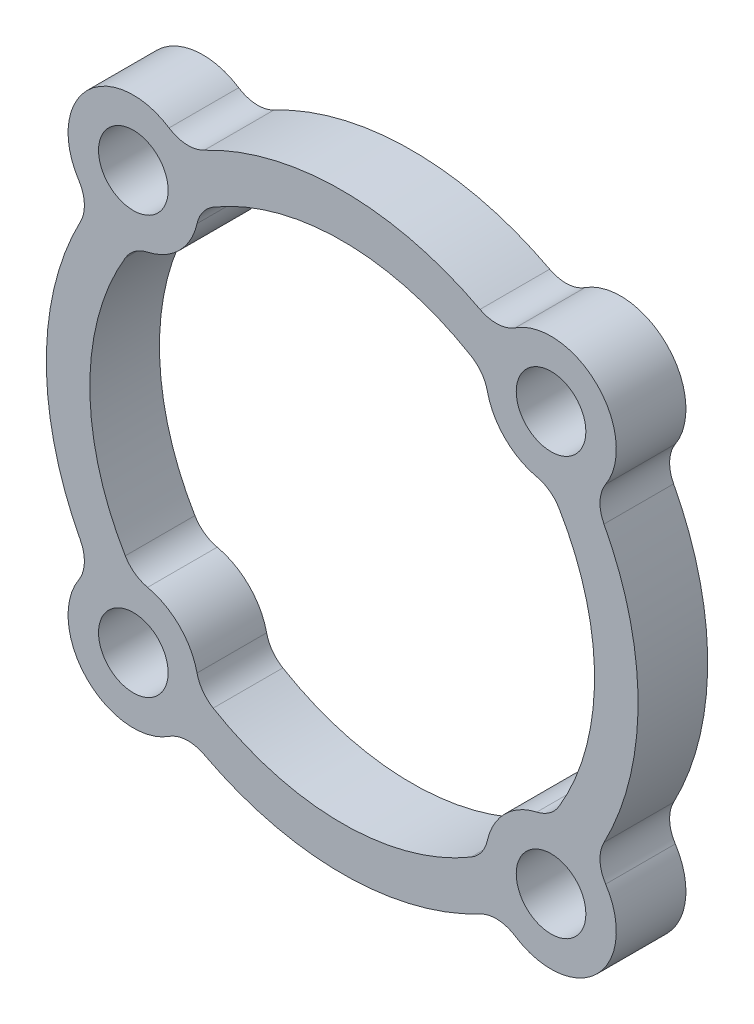
ISO-10303-21;
HEADER;
FILE_DESCRIPTION(('STEP AP214'),'2;1');
FILE_NAME('part.step','',(''),(''),'','','');
FILE_SCHEMA(('AUTOMOTIVE_DESIGN { 1 0 10303 214 1 1 1 1 }'));
ENDSEC;
DATA;
#1=APPLICATION_CONTEXT('core data for automotive mechanical design processes');
#2=APPLICATION_PROTOCOL_DEFINITION('international standard','automotive_design',2000,#1);
#3=PRODUCT_CONTEXT('',#1,'mechanical');
#4=PRODUCT('Part','Part','',(#3));
#5=PRODUCT_RELATED_PRODUCT_CATEGORY('part','',(#4));
#6=PRODUCT_DEFINITION_FORMATION('','',#4);
#7=PRODUCT_DEFINITION_CONTEXT('part definition',#1,'design');
#8=PRODUCT_DEFINITION('design','',#6,#7);
#9=PRODUCT_DEFINITION_SHAPE('','',#8);
#10=(LENGTH_UNIT() NAMED_UNIT(*) SI_UNIT(.MILLI.,.METRE.));
#11=(NAMED_UNIT(*) PLANE_ANGLE_UNIT() SI_UNIT($,.RADIAN.));
#12=(NAMED_UNIT(*) SI_UNIT($,.STERADIAN.) SOLID_ANGLE_UNIT());
#13=UNCERTAINTY_MEASURE_WITH_UNIT(LENGTH_MEASURE(1.E-05),#10,'distance_accuracy_value','');
#14=(GEOMETRIC_REPRESENTATION_CONTEXT(3) GLOBAL_UNCERTAINTY_ASSIGNED_CONTEXT((#13)) GLOBAL_UNIT_ASSIGNED_CONTEXT((#10,
#11,#12)) REPRESENTATION_CONTEXT('',''));
#15=CARTESIAN_POINT('',(0.,0.,0.));
#16=DIRECTION('',(0.,0.,1.));
#17=DIRECTION('',(1.,0.,0.));
#18=AXIS2_PLACEMENT_3D('',#15,#16,#17);
#19=CARTESIAN_POINT('',(0.,0.,4.));
#20=DIRECTION('',(0.,0.,-1.));
#21=DIRECTION('',(-1.,0.,0.));
#22=AXIS2_PLACEMENT_3D('',#19,#20,#21);
#23=CYLINDRICAL_SURFACE('',#22,17.);
#24=CARTESIAN_POINT('',(0.,0.,0.));
#25=DIRECTION('',(0.,0.,1.));
#26=DIRECTION('',(1.,0.,0.));
#27=AXIS2_PLACEMENT_3D('',#24,#25,#26);
#28=CIRCLE('',#27,17.);
#29=CARTESIAN_POINT('',(-7.92039877884297,-15.0421834579991,0.));
#30=VERTEX_POINT('',#29);
#31=CARTESIAN_POINT('',(7.92039877884298,-15.0421834579991,0.));
#32=VERTEX_POINT('',#31);
#33=EDGE_CURVE('E508',#30,#32,#28,.T.);
#34=ORIENTED_EDGE('',*,*,#33,.T.);
#35=DIRECTION('',(0.,0.,-1.));
#36=VECTOR('',#35,1.);
#37=CARTESIAN_POINT('',(7.92039877884298,-15.0421834579991,4.));
#38=LINE('',#37,#36);
#39=CARTESIAN_POINT('',(7.92039877884298,-15.0421834579991,4.));
#40=VERTEX_POINT('',#39);
#41=EDGE_CURVE('E289',#32,#40,#38,.F.);
#42=ORIENTED_EDGE('',*,*,#41,.T.);
#43=CARTESIAN_POINT('',(0.,0.,4.));
#44=DIRECTION('',(0.,0.,1.));
#45=DIRECTION('',(1.,0.,0.));
#46=AXIS2_PLACEMENT_3D('',#43,#44,#45);
#47=CIRCLE('',#46,17.);
#48=CARTESIAN_POINT('',(-7.92039877884297,-15.0421834579991,4.));
#49=VERTEX_POINT('',#48);
#50=EDGE_CURVE('E479',#49,#40,#47,.T.);
#51=ORIENTED_EDGE('',*,*,#50,.F.);
#52=DIRECTION('',(0.,0.,-1.));
#53=VECTOR('',#52,1.);
#54=CARTESIAN_POINT('',(-7.92039877884297,-15.0421834579991,4.));
#55=LINE('',#54,#53);
#56=EDGE_CURVE('E287',#49,#30,#55,.T.);
#57=ORIENTED_EDGE('',*,*,#56,.T.);
#58=EDGE_LOOP('',(#34,#42,#51,#57));
#59=FACE_BOUND('',#58,.T.);
#60=ADVANCED_FACE('F33',(#59),#23,.T.);
#61=CARTESIAN_POINT('',(15.0421834579991,-7.92039877884297,0.));
#62=VERTEX_POINT('',#61);
#63=CARTESIAN_POINT('',(15.0421834579991,7.92039877884297,0.));
#64=VERTEX_POINT('',#63);
#65=EDGE_CURVE('E466',#62,#64,#28,.T.);
#66=ORIENTED_EDGE('',*,*,#65,.T.);
#67=DIRECTION('',(0.,0.,-1.));
#68=VECTOR('',#67,1.);
#69=CARTESIAN_POINT('',(15.0421834579991,7.92039877884297,4.));
#70=LINE('',#69,#68);
#71=CARTESIAN_POINT('',(15.0421834579991,7.92039877884297,4.));
#72=VERTEX_POINT('',#71);
#73=EDGE_CURVE('E274',#64,#72,#70,.F.);
#74=ORIENTED_EDGE('',*,*,#73,.T.);
#75=CARTESIAN_POINT('',(15.0421834579991,-7.92039877884297,4.));
#76=VERTEX_POINT('',#75);
#77=EDGE_CURVE('E252',#76,#72,#47,.T.);
#78=ORIENTED_EDGE('',*,*,#77,.F.);
#79=DIRECTION('',(0.,0.,-1.));
#80=VECTOR('',#79,1.);
#81=CARTESIAN_POINT('',(15.0421834579991,-7.92039877884297,4.));
#82=LINE('',#81,#80);
#83=EDGE_CURVE('E272',#76,#62,#82,.T.);
#84=ORIENTED_EDGE('',*,*,#83,.T.);
#85=EDGE_LOOP('',(#66,#74,#78,#84));
#86=FACE_BOUND('',#85,.T.);
#87=ADVANCED_FACE('F507',(#86),#23,.T.);
#88=CARTESIAN_POINT('',(0.,0.,4.));
#89=DIRECTION('',(0.,0.,-1.));
#90=DIRECTION('',(-1.,0.,0.));
#91=AXIS2_PLACEMENT_3D('',#88,#89,#90);
#92=CYLINDRICAL_SURFACE('',#91,14.5);
#93=CARTESIAN_POINT('',(0.,0.,4.));
#94=DIRECTION('',(0.,0.,1.));
#95=DIRECTION('',(1.,0.,0.));
#96=AXIS2_PLACEMENT_3D('',#93,#94,#95);
#97=CIRCLE('',#96,14.5);
#98=CARTESIAN_POINT('',(-7.41108391552855,-12.4629785844715,4.));
#99=VERTEX_POINT('',#98);
#100=CARTESIAN_POINT('',(7.41108391552855,-12.4629785844715,4.));
#101=VERTEX_POINT('',#100);
#102=EDGE_CURVE('E452',#99,#101,#97,.T.);
#103=ORIENTED_EDGE('',*,*,#102,.T.);
#104=DIRECTION('',(0.,0.,-1.));
#105=VECTOR('',#104,1.);
#106=CARTESIAN_POINT('',(7.41108391552855,-12.4629785844715,4.));
#107=LINE('',#106,#105);
#108=CARTESIAN_POINT('',(7.41108391552855,-12.4629785844715,0.));
#109=VERTEX_POINT('',#108);
#110=EDGE_CURVE('E342',#101,#109,#107,.T.);
#111=ORIENTED_EDGE('',*,*,#110,.T.);
#112=CARTESIAN_POINT('',(0.,0.,0.));
#113=DIRECTION('',(0.,0.,1.));
#114=DIRECTION('',(1.,0.,0.));
#115=AXIS2_PLACEMENT_3D('',#112,#113,#114);
#116=CIRCLE('',#115,14.5);
#117=CARTESIAN_POINT('',(-7.41108391552855,-12.4629785844715,0.));
#118=VERTEX_POINT('',#117);
#119=EDGE_CURVE('E457',#118,#109,#116,.T.);
#120=ORIENTED_EDGE('',*,*,#119,.F.);
#121=DIRECTION('',(0.,0.,-1.));
#122=VECTOR('',#121,1.);
#123=CARTESIAN_POINT('',(-7.41108391552855,-12.4629785844715,4.));
#124=LINE('',#123,#122);
#125=EDGE_CURVE('E339',#118,#99,#124,.F.);
#126=ORIENTED_EDGE('',*,*,#125,.T.);
#127=EDGE_LOOP('',(#103,#111,#120,#126));
#128=FACE_BOUND('',#127,.T.);
#129=ADVANCED_FACE('F543',(#128),#92,.F.);
#130=CARTESIAN_POINT('',(12.4629785844715,-7.41108391552854,0.));
#131=VERTEX_POINT('',#130);
#132=CARTESIAN_POINT('',(12.4629785844715,7.41108391552855,0.));
#133=VERTEX_POINT('',#132);
#134=EDGE_CURVE('E549',#131,#133,#116,.T.);
#135=ORIENTED_EDGE('',*,*,#134,.F.);
#136=DIRECTION('',(0.,0.,-1.));
#137=VECTOR('',#136,1.);
#138=CARTESIAN_POINT('',(12.4629785844715,-7.41108391552854,4.));
#139=LINE('',#138,#137);
#140=CARTESIAN_POINT('',(12.4629785844715,-7.41108391552854,4.));
#141=VERTEX_POINT('',#140);
#142=EDGE_CURVE('E352',#131,#141,#139,.F.);
#143=ORIENTED_EDGE('',*,*,#142,.T.);
#144=CARTESIAN_POINT('',(12.4629785844715,7.41108391552855,4.));
#145=VERTEX_POINT('',#144);
#146=EDGE_CURVE('E567',#141,#145,#97,.T.);
#147=ORIENTED_EDGE('',*,*,#146,.T.);
#148=DIRECTION('',(0.,0.,-1.));
#149=VECTOR('',#148,1.);
#150=CARTESIAN_POINT('',(12.4629785844715,7.41108391552855,4.));
#151=LINE('',#150,#149);
#152=EDGE_CURVE('E349',#145,#133,#151,.T.);
#153=ORIENTED_EDGE('',*,*,#152,.T.);
#154=EDGE_LOOP('',(#135,#143,#147,#153));
#155=FACE_BOUND('',#154,.T.);
#156=ADVANCED_FACE('F565',(#155),#92,.F.);
#157=CARTESIAN_POINT('',(-15.0421834579991,7.92039877884298,0.));
#158=VERTEX_POINT('',#157);
#159=CARTESIAN_POINT('',(-15.0421834579991,-7.92039877884298,0.));
#160=VERTEX_POINT('',#159);
#161=EDGE_CURVE('E462',#158,#160,#28,.T.);
#162=ORIENTED_EDGE('',*,*,#161,.T.);
#163=DIRECTION('',(0.,0.,-1.));
#164=VECTOR('',#163,1.);
#165=CARTESIAN_POINT('',(-15.0421834579991,-7.92039877884298,4.));
#166=LINE('',#165,#164);
#167=CARTESIAN_POINT('',(-15.0421834579991,-7.92039877884298,4.));
#168=VERTEX_POINT('',#167);
#169=EDGE_CURVE('E300',#160,#168,#166,.F.);
#170=ORIENTED_EDGE('',*,*,#169,.T.);
#171=CARTESIAN_POINT('',(-15.0421834579991,7.92039877884298,4.));
#172=VERTEX_POINT('',#171);
#173=EDGE_CURVE('E463',#172,#168,#47,.T.);
#174=ORIENTED_EDGE('',*,*,#173,.F.);
#175=DIRECTION('',(0.,0.,-1.));
#176=VECTOR('',#175,1.);
#177=CARTESIAN_POINT('',(-15.0421834579991,7.92039877884298,4.));
#178=LINE('',#177,#176);
#179=EDGE_CURVE('E297',#172,#158,#178,.T.);
#180=ORIENTED_EDGE('',*,*,#179,.T.);
#181=EDGE_LOOP('',(#162,#170,#174,#180));
#182=FACE_BOUND('',#181,.T.);
#183=ADVANCED_FACE('F513',(#182),#23,.T.);
#184=CARTESIAN_POINT('',(-12.4629785844715,7.41108391552855,4.));
#185=VERTEX_POINT('',#184);
#186=CARTESIAN_POINT('',(-12.4629785844715,-7.41108391552855,4.));
#187=VERTEX_POINT('',#186);
#188=EDGE_CURVE('E448',#185,#187,#97,.T.);
#189=ORIENTED_EDGE('',*,*,#188,.T.);
#190=DIRECTION('',(0.,0.,-1.));
#191=VECTOR('',#190,1.);
#192=CARTESIAN_POINT('',(-12.4629785844715,-7.41108391552855,4.));
#193=LINE('',#192,#191);
#194=CARTESIAN_POINT('',(-12.4629785844715,-7.41108391552855,0.));
#195=VERTEX_POINT('',#194);
#196=EDGE_CURVE('E370',#187,#195,#193,.T.);
#197=ORIENTED_EDGE('',*,*,#196,.T.);
#198=CARTESIAN_POINT('',(-12.4629785844715,7.41108391552855,0.));
#199=VERTEX_POINT('',#198);
#200=EDGE_CURVE('E454',#199,#195,#116,.T.);
#201=ORIENTED_EDGE('',*,*,#200,.F.);
#202=DIRECTION('',(0.,0.,-1.));
#203=VECTOR('',#202,1.);
#204=CARTESIAN_POINT('',(-12.4629785844715,7.41108391552855,4.));
#205=LINE('',#204,#203);
#206=EDGE_CURVE('E368',#199,#185,#205,.F.);
#207=ORIENTED_EDGE('',*,*,#206,.T.);
#208=EDGE_LOOP('',(#189,#197,#201,#207));
#209=FACE_BOUND('',#208,.T.);
#210=ADVANCED_FACE('F581',(#209),#92,.F.);
#211=CARTESIAN_POINT('',(7.92039877884297,15.0421834579991,4.));
#212=VERTEX_POINT('',#211);
#213=CARTESIAN_POINT('',(-7.92039877884298,15.0421834579991,4.));
#214=VERTEX_POINT('',#213);
#215=EDGE_CURVE('E459',#212,#214,#47,.T.);
#216=ORIENTED_EDGE('',*,*,#215,.F.);
#217=DIRECTION('',(0.,0.,-1.));
#218=VECTOR('',#217,1.);
#219=CARTESIAN_POINT('',(7.92039877884297,15.0421834579991,4.));
#220=LINE('',#219,#218);
#221=CARTESIAN_POINT('',(7.92039877884297,15.0421834579991,0.));
#222=VERTEX_POINT('',#221);
#223=EDGE_CURVE('E309',#212,#222,#220,.T.);
#224=ORIENTED_EDGE('',*,*,#223,.T.);
#225=CARTESIAN_POINT('',(-7.92039877884298,15.0421834579991,0.));
#226=VERTEX_POINT('',#225);
#227=EDGE_CURVE('E451',#222,#226,#28,.T.);
#228=ORIENTED_EDGE('',*,*,#227,.T.);
#229=DIRECTION('',(0.,0.,-1.));
#230=VECTOR('',#229,1.);
#231=CARTESIAN_POINT('',(-7.92039877884298,15.0421834579991,4.));
#232=LINE('',#231,#230);
#233=EDGE_CURVE('E306',#226,#214,#232,.F.);
#234=ORIENTED_EDGE('',*,*,#233,.T.);
#235=EDGE_LOOP('',(#216,#224,#228,#234));
#236=FACE_BOUND('',#235,.T.);
#237=ADVANCED_FACE('F608',(#236),#23,.T.);
#238=CARTESIAN_POINT('',(7.41108391552855,12.4629785844715,0.));
#239=VERTEX_POINT('',#238);
#240=CARTESIAN_POINT('',(-7.41108391552855,12.4629785844715,0.));
#241=VERTEX_POINT('',#240);
#242=EDGE_CURVE('E458',#239,#241,#116,.T.);
#243=ORIENTED_EDGE('',*,*,#242,.F.);
#244=DIRECTION('',(0.,0.,-1.));
#245=VECTOR('',#244,1.);
#246=CARTESIAN_POINT('',(7.41108391552855,12.4629785844715,4.));
#247=LINE('',#246,#245);
#248=CARTESIAN_POINT('',(7.41108391552855,12.4629785844715,4.));
#249=VERTEX_POINT('',#248);
#250=EDGE_CURVE('E361',#239,#249,#247,.F.);
#251=ORIENTED_EDGE('',*,*,#250,.T.);
#252=CARTESIAN_POINT('',(-7.41108391552855,12.4629785844715,4.));
#253=VERTEX_POINT('',#252);
#254=EDGE_CURVE('E453',#249,#253,#97,.T.);
#255=ORIENTED_EDGE('',*,*,#254,.T.);
#256=DIRECTION('',(0.,0.,-1.));
#257=VECTOR('',#256,1.);
#258=CARTESIAN_POINT('',(-7.41108391552855,12.4629785844715,4.));
#259=LINE('',#258,#257);
#260=EDGE_CURVE('E359',#253,#241,#259,.T.);
#261=ORIENTED_EDGE('',*,*,#260,.T.);
#262=EDGE_LOOP('',(#243,#251,#255,#261));
#263=FACE_BOUND('',#262,.T.);
#264=ADVANCED_FACE('F571',(#263),#92,.F.);
#265=CARTESIAN_POINT('',(-12.,12.,4.));
#266=DIRECTION('',(0.,0.,-1.));
#267=DIRECTION('',(-1.,0.,0.));
#268=AXIS2_PLACEMENT_3D('',#265,#266,#267);
#269=CYLINDRICAL_SURFACE('',#268,3.75);
#270=CARTESIAN_POINT('',(-12.,12.,0.));
#271=DIRECTION('',(0.,0.,1.));
#272=DIRECTION('',(1.,0.,0.));
#273=AXIS2_PLACEMENT_3D('',#270,#271,#272);
#274=CIRCLE('',#273,3.75);
#275=CARTESIAN_POINT('',(-9.94709373905434,15.1381644131196,0.));
#276=VERTEX_POINT('',#275);
#277=CARTESIAN_POINT('',(-15.1381644131196,9.94709373905434,0.));
#278=VERTEX_POINT('',#277);
#279=EDGE_CURVE('E469',#276,#278,#274,.T.);
#280=ORIENTED_EDGE('',*,*,#279,.T.);
#281=DIRECTION('',(0.,0.,-1.));
#282=VECTOR('',#281,1.);
#283=CARTESIAN_POINT('',(-15.1381644131196,9.94709373905434,4.));
#284=LINE('',#283,#282);
#285=CARTESIAN_POINT('',(-15.1381644131196,9.94709373905434,4.));
#286=VERTEX_POINT('',#285);
#287=EDGE_CURVE('E304',#278,#286,#284,.F.);
#288=ORIENTED_EDGE('',*,*,#287,.T.);
#289=CARTESIAN_POINT('',(-12.,12.,4.));
#290=DIRECTION('',(0.,0.,1.));
#291=DIRECTION('',(1.,0.,0.));
#292=AXIS2_PLACEMENT_3D('',#289,#290,#291);
#293=CIRCLE('',#292,3.75);
#294=CARTESIAN_POINT('',(-9.94709373905434,15.1381644131196,4.));
#295=VERTEX_POINT('',#294);
#296=EDGE_CURVE('E276',#295,#286,#293,.T.);
#297=ORIENTED_EDGE('',*,*,#296,.F.);
#298=DIRECTION('',(0.,0.,-1.));
#299=VECTOR('',#298,1.);
#300=CARTESIAN_POINT('',(-9.94709373905434,15.1381644131196,4.));
#301=LINE('',#300,#299);
#302=EDGE_CURVE('E302',#295,#276,#301,.T.);
#303=ORIENTED_EDGE('',*,*,#302,.T.);
#304=EDGE_LOOP('',(#280,#288,#297,#303));
#305=FACE_BOUND('',#304,.T.);
#306=ADVANCED_FACE('F621',(#305),#269,.T.);
#307=CARTESIAN_POINT('',(-11.1808350362471,8.34056442027467,0.));
#308=VERTEX_POINT('',#307);
#309=CARTESIAN_POINT('',(-8.34056442027467,11.1808350362471,0.));
#310=VERTEX_POINT('',#309);
#311=EDGE_CURVE('E471',#308,#310,#274,.T.);
#312=ORIENTED_EDGE('',*,*,#311,.T.);
#313=DIRECTION('',(0.,0.,-1.));
#314=VECTOR('',#313,1.);
#315=CARTESIAN_POINT('',(-8.34056442027467,11.1808350362471,4.));
#316=LINE('',#315,#314);
#317=CARTESIAN_POINT('',(-8.34056442027467,11.1808350362471,4.));
#318=VERTEX_POINT('',#317);
#319=EDGE_CURVE('E375',#310,#318,#316,.F.);
#320=ORIENTED_EDGE('',*,*,#319,.T.);
#321=CARTESIAN_POINT('',(-11.1808350362471,8.34056442027467,4.));
#322=VERTEX_POINT('',#321);
#323=EDGE_CURVE('E468',#322,#318,#293,.T.);
#324=ORIENTED_EDGE('',*,*,#323,.F.);
#325=DIRECTION('',(0.,0.,-1.));
#326=VECTOR('',#325,1.);
#327=CARTESIAN_POINT('',(-11.1808350362471,8.34056442027467,4.));
#328=LINE('',#327,#326);
#329=EDGE_CURVE('E373',#322,#308,#328,.T.);
#330=ORIENTED_EDGE('',*,*,#329,.T.);
#331=EDGE_LOOP('',(#312,#320,#324,#330));
#332=FACE_BOUND('',#331,.T.);
#333=ADVANCED_FACE('F576',(#332),#269,.T.);
#334=CARTESIAN_POINT('',(-12.,12.,4.));
#335=DIRECTION('',(0.,0.,1.));
#336=DIRECTION('',(1.,0.,0.));
#337=AXIS2_PLACEMENT_3D('',#334,#335,#336);
#338=PLANE('',#337);
#339=CARTESIAN_POINT('',(12.,12.,4.));
#340=DIRECTION('',(0.,0.,1.));
#341=DIRECTION('',(1.,0.,0.));
#342=AXIS2_PLACEMENT_3D('',#339,#340,#341);
#343=CIRCLE('',#342,2.00000000000001);
#344=CARTESIAN_POINT('',(14.,12.,4.));
#345=VERTEX_POINT('',#344);
#346=EDGE_CURVE('E37',#345,#345,#343,.T.);
#347=ORIENTED_EDGE('',*,*,#346,.F.);
#348=EDGE_LOOP('',(#347));
#349=FACE_BOUND('',#348,.T.);
#350=CARTESIAN_POINT('',(-12.,12.,4.));
#351=DIRECTION('',(0.,0.,1.));
#352=DIRECTION('',(1.,0.,0.));
#353=AXIS2_PLACEMENT_3D('',#350,#351,#352);
#354=CIRCLE('',#353,2.00000000000001);
#355=CARTESIAN_POINT('',(-9.99999999999999,12.,4.));
#356=VERTEX_POINT('',#355);
#357=EDGE_CURVE('E410',#356,#356,#354,.T.);
#358=ORIENTED_EDGE('',*,*,#357,.F.);
#359=EDGE_LOOP('',(#358));
#360=FACE_BOUND('',#359,.T.);
#361=CARTESIAN_POINT('',(-12.,-12.,4.));
#362=DIRECTION('',(0.,0.,1.));
#363=DIRECTION('',(1.,0.,0.));
#364=AXIS2_PLACEMENT_3D('',#361,#362,#363);
#365=CIRCLE('',#364,2.00000000000001);
#366=CARTESIAN_POINT('',(-9.99999999999999,-12.,4.));
#367=VERTEX_POINT('',#366);
#368=EDGE_CURVE('E406',#367,#367,#365,.T.);
#369=ORIENTED_EDGE('',*,*,#368,.F.);
#370=EDGE_LOOP('',(#369));
#371=FACE_BOUND('',#370,.T.);
#372=CARTESIAN_POINT('',(12.,-12.,4.));
#373=DIRECTION('',(0.,0.,1.));
#374=DIRECTION('',(1.,0.,0.));
#375=AXIS2_PLACEMENT_3D('',#372,#373,#374);
#376=CIRCLE('',#375,2.00000000000001);
#377=CARTESIAN_POINT('',(14.,-12.,4.));
#378=VERTEX_POINT('',#377);
#379=EDGE_CURVE('E427',#378,#378,#376,.T.);
#380=ORIENTED_EDGE('',*,*,#379,.F.);
#381=EDGE_LOOP('',(#380));
#382=FACE_BOUND('',#381,.T.);
#383=ORIENTED_EDGE('',*,*,#146,.F.);
#384=CARTESIAN_POINT('',(10.7439470555788,-6.38886544442116,4.));
#385=DIRECTION('',(0.,0.,1.));
#386=DIRECTION('',(1.,0.,0.));
#387=AXIS2_PLACEMENT_3D('',#384,#385,#386);
#388=CIRCLE('',#387,2.);
#389=CARTESIAN_POINT('',(11.1808350362471,-8.34056442027467,4.));
#390=VERTEX_POINT('',#389);
#391=EDGE_CURVE('E382',#141,#390,#388,.F.);
#392=ORIENTED_EDGE('',*,*,#391,.T.);
#393=CARTESIAN_POINT('',(12.,-12.,4.));
#394=DIRECTION('',(0.,0.,1.));
#395=DIRECTION('',(1.,0.,0.));
#396=AXIS2_PLACEMENT_3D('',#393,#394,#395);
#397=CIRCLE('',#396,3.75);
#398=CARTESIAN_POINT('',(8.34056442027467,-11.1808350362471,4.));
#399=VERTEX_POINT('',#398);
#400=EDGE_CURVE('E434',#390,#399,#397,.T.);
#401=ORIENTED_EDGE('',*,*,#400,.T.);
#402=CARTESIAN_POINT('',(6.38886544442116,-10.7439470555788,4.));
#403=DIRECTION('',(0.,0.,1.));
#404=DIRECTION('',(1.,0.,0.));
#405=AXIS2_PLACEMENT_3D('',#402,#403,#404);
#406=CIRCLE('',#405,2.);
#407=EDGE_CURVE('E380',#399,#101,#406,.F.);
#408=ORIENTED_EDGE('',*,*,#407,.T.);
#409=ORIENTED_EDGE('',*,*,#102,.F.);
#410=CARTESIAN_POINT('',(-6.38886544442116,-10.7439470555788,4.));
#411=DIRECTION('',(0.,0.,1.));
#412=DIRECTION('',(1.,0.,0.));
#413=AXIS2_PLACEMENT_3D('',#410,#411,#412);
#414=CIRCLE('',#413,2.);
#415=CARTESIAN_POINT('',(-8.34056442027467,-11.1808350362471,4.));
#416=VERTEX_POINT('',#415);
#417=EDGE_CURVE('E394',#99,#416,#414,.F.);
#418=ORIENTED_EDGE('',*,*,#417,.T.);
#419=CARTESIAN_POINT('',(-12.,-12.,4.));
#420=DIRECTION('',(0.,0.,1.));
#421=DIRECTION('',(1.,0.,0.));
#422=AXIS2_PLACEMENT_3D('',#419,#420,#421);
#423=CIRCLE('',#422,3.75);
#424=CARTESIAN_POINT('',(-11.1808350362471,-8.34056442027467,4.));
#425=VERTEX_POINT('',#424);
#426=EDGE_CURVE('E438',#416,#425,#423,.T.);
#427=ORIENTED_EDGE('',*,*,#426,.T.);
#428=CARTESIAN_POINT('',(-10.7439470555788,-6.38886544442116,4.));
#429=DIRECTION('',(0.,0.,1.));
#430=DIRECTION('',(1.,0.,0.));
#431=AXIS2_PLACEMENT_3D('',#428,#429,#430);
#432=CIRCLE('',#431,2.);
#433=EDGE_CURVE('E400',#425,#187,#432,.F.);
#434=ORIENTED_EDGE('',*,*,#433,.T.);
#435=ORIENTED_EDGE('',*,*,#188,.F.);
#436=CARTESIAN_POINT('',(-10.7439470555788,6.38886544442116,4.));
#437=DIRECTION('',(0.,0.,1.));
#438=DIRECTION('',(1.,0.,0.));
#439=AXIS2_PLACEMENT_3D('',#436,#437,#438);
#440=CIRCLE('',#439,2.);
#441=EDGE_CURVE('E11',#185,#322,#440,.F.);
#442=ORIENTED_EDGE('',*,*,#441,.T.);
#443=ORIENTED_EDGE('',*,*,#323,.T.);
#444=CARTESIAN_POINT('',(-6.38886544442116,10.7439470555788,4.));
#445=DIRECTION('',(0.,0.,1.));
#446=DIRECTION('',(1.,0.,0.));
#447=AXIS2_PLACEMENT_3D('',#444,#445,#446);
#448=CIRCLE('',#447,2.);
#449=EDGE_CURVE('E402',#318,#253,#448,.F.);
#450=ORIENTED_EDGE('',*,*,#449,.T.);
#451=ORIENTED_EDGE('',*,*,#254,.F.);
#452=CARTESIAN_POINT('',(6.38886544442116,10.7439470555788,4.));
#453=DIRECTION('',(0.,0.,1.));
#454=DIRECTION('',(1.,0.,0.));
#455=AXIS2_PLACEMENT_3D('',#452,#453,#454);
#456=CIRCLE('',#455,2.);
#457=CARTESIAN_POINT('',(8.34056442027467,11.1808350362471,4.));
#458=VERTEX_POINT('',#457);
#459=EDGE_CURVE('E390',#249,#458,#456,.F.);
#460=ORIENTED_EDGE('',*,*,#459,.T.);
#461=CARTESIAN_POINT('',(12.,12.,4.));
#462=DIRECTION('',(0.,0.,1.));
#463=DIRECTION('',(1.,0.,0.));
#464=AXIS2_PLACEMENT_3D('',#461,#462,#463);
#465=CIRCLE('',#464,3.75);
#466=CARTESIAN_POINT('',(11.1808350362471,8.34056442027467,4.));
#467=VERTEX_POINT('',#466);
#468=EDGE_CURVE('E268',#458,#467,#465,.T.);
#469=ORIENTED_EDGE('',*,*,#468,.T.);
#470=CARTESIAN_POINT('',(10.7439470555788,6.38886544442116,4.));
#471=DIRECTION('',(0.,0.,1.));
#472=DIRECTION('',(1.,0.,0.));
#473=AXIS2_PLACEMENT_3D('',#470,#471,#472);
#474=CIRCLE('',#473,2.);
#475=EDGE_CURVE('E388',#467,#145,#474,.F.);
#476=ORIENTED_EDGE('',*,*,#475,.T.);
#477=EDGE_LOOP('',(#383,#392,#401,#408,#409,#418,#427,#434,#435,#442,#443,#450,#451,#460,#469,#476));
#478=FACE_BOUND('',#477,.T.);
#479=CARTESIAN_POINT('',(-15.1381644131196,-9.94709373905434,4.));
#480=VERTEX_POINT('',#479);
#481=CARTESIAN_POINT('',(-9.94709373905434,-15.1381644131196,4.));
#482=VERTEX_POINT('',#481);
#483=EDGE_CURVE('E442',#480,#482,#423,.T.);
#484=ORIENTED_EDGE('',*,*,#483,.T.);
#485=CARTESIAN_POINT('',(-8.85221039988332,-16.8118521001167,4.));
#486=DIRECTION('',(0.,0.,1.));
#487=DIRECTION('',(1.,0.,0.));
#488=AXIS2_PLACEMENT_3D('',#485,#486,#487);
#489=CIRCLE('',#488,2.);
#490=EDGE_CURVE('E319',#482,#49,#489,.F.);
#491=ORIENTED_EDGE('',*,*,#490,.T.);
#492=ORIENTED_EDGE('',*,*,#50,.T.);
#493=CARTESIAN_POINT('',(8.85221039988333,-16.8118521001167,4.));
#494=DIRECTION('',(0.,0.,1.));
#495=DIRECTION('',(1.,0.,0.));
#496=AXIS2_PLACEMENT_3D('',#493,#494,#495);
#497=CIRCLE('',#496,2.);
#498=CARTESIAN_POINT('',(9.94709373905435,-15.1381644131196,4.));
#499=VERTEX_POINT('',#498);
#500=EDGE_CURVE('E317',#40,#499,#497,.F.);
#501=ORIENTED_EDGE('',*,*,#500,.T.);
#502=CARTESIAN_POINT('',(15.1381644131196,-9.94709373905434,4.));
#503=VERTEX_POINT('',#502);
#504=EDGE_CURVE('E431',#499,#503,#397,.T.);
#505=ORIENTED_EDGE('',*,*,#504,.T.);
#506=CARTESIAN_POINT('',(16.8118521001167,-8.85221039988332,4.));
#507=DIRECTION('',(0.,0.,1.));
#508=DIRECTION('',(1.,0.,0.));
#509=AXIS2_PLACEMENT_3D('',#506,#507,#508);
#510=CIRCLE('',#509,2.);
#511=EDGE_CURVE('E256',#503,#76,#510,.F.);
#512=ORIENTED_EDGE('',*,*,#511,.T.);
#513=ORIENTED_EDGE('',*,*,#77,.T.);
#514=CARTESIAN_POINT('',(16.8118521001167,8.85221039988332,4.));
#515=DIRECTION('',(0.,0.,1.));
#516=DIRECTION('',(1.,0.,0.));
#517=AXIS2_PLACEMENT_3D('',#514,#515,#516);
#518=CIRCLE('',#517,2.);
#519=CARTESIAN_POINT('',(15.1381644131196,9.94709373905434,4.));
#520=VERTEX_POINT('',#519);
#521=EDGE_CURVE('E246',#72,#520,#518,.F.);
#522=ORIENTED_EDGE('',*,*,#521,.T.);
#523=CARTESIAN_POINT('',(9.94709373905434,15.1381644131196,4.));
#524=VERTEX_POINT('',#523);
#525=EDGE_CURVE('E250',#520,#524,#465,.T.);
#526=ORIENTED_EDGE('',*,*,#525,.T.);
#527=CARTESIAN_POINT('',(8.85221039988332,16.8118521001167,4.));
#528=DIRECTION('',(0.,0.,1.));
#529=DIRECTION('',(1.,0.,0.));
#530=AXIS2_PLACEMENT_3D('',#527,#528,#529);
#531=CIRCLE('',#530,2.);
#532=EDGE_CURVE('E331',#524,#212,#531,.F.);
#533=ORIENTED_EDGE('',*,*,#532,.T.);
#534=ORIENTED_EDGE('',*,*,#215,.T.);
#535=CARTESIAN_POINT('',(-8.85221039988333,16.8118521001167,4.));
#536=DIRECTION('',(0.,0.,1.));
#537=DIRECTION('',(1.,0.,0.));
#538=AXIS2_PLACEMENT_3D('',#535,#536,#537);
#539=CIRCLE('',#538,2.);
#540=EDGE_CURVE('E335',#214,#295,#539,.F.);
#541=ORIENTED_EDGE('',*,*,#540,.T.);
#542=ORIENTED_EDGE('',*,*,#296,.T.);
#543=CARTESIAN_POINT('',(-16.8118521001167,8.85221039988333,4.));
#544=DIRECTION('',(0.,0.,1.));
#545=DIRECTION('',(1.,0.,0.));
#546=AXIS2_PLACEMENT_3D('',#543,#544,#545);
#547=CIRCLE('',#546,2.);
#548=EDGE_CURVE('E329',#286,#172,#547,.F.);
#549=ORIENTED_EDGE('',*,*,#548,.T.);
#550=ORIENTED_EDGE('',*,*,#173,.T.);
#551=CARTESIAN_POINT('',(-16.8118521001167,-8.85221039988333,4.));
#552=DIRECTION('',(0.,0.,1.));
#553=DIRECTION('',(1.,0.,0.));
#554=AXIS2_PLACEMENT_3D('',#551,#552,#553);
#555=CIRCLE('',#554,2.);
#556=EDGE_CURVE('E325',#168,#480,#555,.F.);
#557=ORIENTED_EDGE('',*,*,#556,.T.);
#558=EDGE_LOOP('',(#484,#491,#492,#501,#505,#512,#513,#522,#526,#533,#534,#541,#542,#549,#550,#557));
#559=FACE_BOUND('',#558,.T.);
#560=ADVANCED_FACE('F249',(#349,#360,#371,#382,#478,#559),#338,.T.);
#561=CARTESIAN_POINT('',(-12.,12.,0.));
#562=DIRECTION('',(0.,0.,1.));
#563=DIRECTION('',(1.,0.,0.));
#564=AXIS2_PLACEMENT_3D('',#561,#562,#563);
#565=PLANE('',#564);
#566=CARTESIAN_POINT('',(12.,12.,0.));
#567=DIRECTION('',(0.,0.,-1.));
#568=DIRECTION('',(-1.,0.,0.));
#569=AXIS2_PLACEMENT_3D('',#566,#567,#568);
#570=CIRCLE('',#569,2.00000000000001);
#571=CARTESIAN_POINT('',(9.99999999999998,12.,0.));
#572=VERTEX_POINT('',#571);
#573=EDGE_CURVE('E422',#572,#572,#570,.T.);
#574=ORIENTED_EDGE('',*,*,#573,.F.);
#575=EDGE_LOOP('',(#574));
#576=FACE_BOUND('',#575,.T.);
#577=CARTESIAN_POINT('',(-12.,12.,0.));
#578=DIRECTION('',(0.,0.,-1.));
#579=DIRECTION('',(-1.,0.,0.));
#580=AXIS2_PLACEMENT_3D('',#577,#578,#579);
#581=CIRCLE('',#580,2.00000000000001);
#582=CARTESIAN_POINT('',(-14.,12.,0.));
#583=VERTEX_POINT('',#582);
#584=EDGE_CURVE('E412',#583,#583,#581,.T.);
#585=ORIENTED_EDGE('',*,*,#584,.F.);
#586=EDGE_LOOP('',(#585));
#587=FACE_BOUND('',#586,.T.);
#588=CARTESIAN_POINT('',(-12.,-12.,0.));
#589=DIRECTION('',(0.,0.,-1.));
#590=DIRECTION('',(-1.,0.,0.));
#591=AXIS2_PLACEMENT_3D('',#588,#589,#590);
#592=CIRCLE('',#591,2.00000000000001);
#593=CARTESIAN_POINT('',(-14.,-12.,0.));
#594=VERTEX_POINT('',#593);
#595=EDGE_CURVE('E409',#594,#594,#592,.T.);
#596=ORIENTED_EDGE('',*,*,#595,.F.);
#597=EDGE_LOOP('',(#596));
#598=FACE_BOUND('',#597,.T.);
#599=CARTESIAN_POINT('',(12.,-12.,0.));
#600=DIRECTION('',(0.,0.,-1.));
#601=DIRECTION('',(-1.,0.,0.));
#602=AXIS2_PLACEMENT_3D('',#599,#600,#601);
#603=CIRCLE('',#602,2.00000000000001);
#604=CARTESIAN_POINT('',(9.99999999999999,-12.,0.));
#605=VERTEX_POINT('',#604);
#606=EDGE_CURVE('E408',#605,#605,#603,.T.);
#607=ORIENTED_EDGE('',*,*,#606,.F.);
#608=EDGE_LOOP('',(#607));
#609=FACE_BOUND('',#608,.T.);
#610=CARTESIAN_POINT('',(-12.,-12.,0.));
#611=DIRECTION('',(0.,0.,1.));
#612=DIRECTION('',(1.,0.,0.));
#613=AXIS2_PLACEMENT_3D('',#610,#611,#612);
#614=CIRCLE('',#613,3.75);
#615=CARTESIAN_POINT('',(-8.34056442027467,-11.1808350362471,0.));
#616=VERTEX_POINT('',#615);
#617=CARTESIAN_POINT('',(-11.1808350362471,-8.34056442027467,0.));
#618=VERTEX_POINT('',#617);
#619=EDGE_CURVE('E443',#616,#618,#614,.T.);
#620=ORIENTED_EDGE('',*,*,#619,.F.);
#621=CARTESIAN_POINT('',(-6.38886544442116,-10.7439470555788,0.));
#622=DIRECTION('',(0.,0.,1.));
#623=DIRECTION('',(1.,0.,0.));
#624=AXIS2_PLACEMENT_3D('',#621,#622,#623);
#625=CIRCLE('',#624,2.);
#626=EDGE_CURVE('E396',#616,#118,#625,.T.);
#627=ORIENTED_EDGE('',*,*,#626,.T.);
#628=ORIENTED_EDGE('',*,*,#119,.T.);
#629=CARTESIAN_POINT('',(6.38886544442116,-10.7439470555788,0.));
#630=DIRECTION('',(0.,0.,1.));
#631=DIRECTION('',(1.,0.,0.));
#632=AXIS2_PLACEMENT_3D('',#629,#630,#631);
#633=CIRCLE('',#632,2.);
#634=CARTESIAN_POINT('',(8.34056442027467,-11.1808350362471,0.));
#635=VERTEX_POINT('',#634);
#636=EDGE_CURVE('E378',#109,#635,#633,.T.);
#637=ORIENTED_EDGE('',*,*,#636,.T.);
#638=CARTESIAN_POINT('',(12.,-12.,0.));
#639=DIRECTION('',(0.,0.,1.));
#640=DIRECTION('',(1.,0.,0.));
#641=AXIS2_PLACEMENT_3D('',#638,#639,#640);
#642=CIRCLE('',#641,3.75);
#643=CARTESIAN_POINT('',(11.1808350362471,-8.34056442027467,0.));
#644=VERTEX_POINT('',#643);
#645=EDGE_CURVE('E435',#644,#635,#642,.T.);
#646=ORIENTED_EDGE('',*,*,#645,.F.);
#647=CARTESIAN_POINT('',(10.7439470555788,-6.38886544442116,0.));
#648=DIRECTION('',(0.,0.,1.));
#649=DIRECTION('',(1.,0.,0.));
#650=AXIS2_PLACEMENT_3D('',#647,#648,#649);
#651=CIRCLE('',#650,2.);
#652=EDGE_CURVE('E384',#644,#131,#651,.T.);
#653=ORIENTED_EDGE('',*,*,#652,.T.);
#654=ORIENTED_EDGE('',*,*,#134,.T.);
#655=CARTESIAN_POINT('',(10.7439470555788,6.38886544442116,0.));
#656=DIRECTION('',(0.,0.,1.));
#657=DIRECTION('',(1.,0.,0.));
#658=AXIS2_PLACEMENT_3D('',#655,#656,#657);
#659=CIRCLE('',#658,2.);
#660=CARTESIAN_POINT('',(11.1808350362471,8.34056442027467,0.));
#661=VERTEX_POINT('',#660);
#662=EDGE_CURVE('E386',#133,#661,#659,.T.);
#663=ORIENTED_EDGE('',*,*,#662,.T.);
#664=CARTESIAN_POINT('',(12.,12.,0.));
#665=DIRECTION('',(0.,0.,1.));
#666=DIRECTION('',(1.,0.,0.));
#667=AXIS2_PLACEMENT_3D('',#664,#665,#666);
#668=CIRCLE('',#667,3.75);
#669=CARTESIAN_POINT('',(8.34056442027467,11.1808350362471,0.));
#670=VERTEX_POINT('',#669);
#671=EDGE_CURVE('E269',#670,#661,#668,.T.);
#672=ORIENTED_EDGE('',*,*,#671,.F.);
#673=CARTESIAN_POINT('',(6.38886544442116,10.7439470555788,0.));
#674=DIRECTION('',(0.,0.,1.));
#675=DIRECTION('',(1.,0.,0.));
#676=AXIS2_PLACEMENT_3D('',#673,#674,#675);
#677=CIRCLE('',#676,2.);
#678=EDGE_CURVE('E392',#670,#239,#677,.T.);
#679=ORIENTED_EDGE('',*,*,#678,.T.);
#680=ORIENTED_EDGE('',*,*,#242,.T.);
#681=CARTESIAN_POINT('',(-6.38886544442116,10.7439470555788,0.));
#682=DIRECTION('',(0.,0.,1.));
#683=DIRECTION('',(1.,0.,0.));
#684=AXIS2_PLACEMENT_3D('',#681,#682,#683);
#685=CIRCLE('',#684,2.);
#686=EDGE_CURVE('E50',#241,#310,#685,.T.);
#687=ORIENTED_EDGE('',*,*,#686,.T.);
#688=ORIENTED_EDGE('',*,*,#311,.F.);
#689=CARTESIAN_POINT('',(-10.7439470555788,6.38886544442116,0.));
#690=DIRECTION('',(0.,0.,1.));
#691=DIRECTION('',(1.,0.,0.));
#692=AXIS2_PLACEMENT_3D('',#689,#690,#691);
#693=CIRCLE('',#692,2.);
#694=EDGE_CURVE('E42',#308,#199,#693,.T.);
#695=ORIENTED_EDGE('',*,*,#694,.T.);
#696=ORIENTED_EDGE('',*,*,#200,.T.);
#697=CARTESIAN_POINT('',(-10.7439470555788,-6.38886544442116,0.));
#698=DIRECTION('',(0.,0.,1.));
#699=DIRECTION('',(1.,0.,0.));
#700=AXIS2_PLACEMENT_3D('',#697,#698,#699);
#701=CIRCLE('',#700,2.);
#702=EDGE_CURVE('E398',#195,#618,#701,.T.);
#703=ORIENTED_EDGE('',*,*,#702,.T.);
#704=EDGE_LOOP('',(#620,#627,#628,#637,#646,#653,#654,#663,#672,#679,#680,#687,#688,#695,#696,#703));
#705=FACE_BOUND('',#704,.T.);
#706=ORIENTED_EDGE('',*,*,#65,.F.);
#707=CARTESIAN_POINT('',(16.8118521001167,-8.85221039988332,0.));
#708=DIRECTION('',(0.,0.,1.));
#709=DIRECTION('',(1.,0.,0.));
#710=AXIS2_PLACEMENT_3D('',#707,#708,#709);
#711=CIRCLE('',#710,2.);
#712=CARTESIAN_POINT('',(15.1381644131196,-9.94709373905434,0.));
#713=VERTEX_POINT('',#712);
#714=EDGE_CURVE('E313',#62,#713,#711,.T.);
#715=ORIENTED_EDGE('',*,*,#714,.T.);
#716=CARTESIAN_POINT('',(9.94709373905435,-15.1381644131196,0.));
#717=VERTEX_POINT('',#716);
#718=EDGE_CURVE('E430',#717,#713,#642,.T.);
#719=ORIENTED_EDGE('',*,*,#718,.F.);
#720=CARTESIAN_POINT('',(8.85221039988333,-16.8118521001167,0.));
#721=DIRECTION('',(0.,0.,1.));
#722=DIRECTION('',(1.,0.,0.));
#723=AXIS2_PLACEMENT_3D('',#720,#721,#722);
#724=CIRCLE('',#723,2.);
#725=EDGE_CURVE('E315',#717,#32,#724,.T.);
#726=ORIENTED_EDGE('',*,*,#725,.T.);
#727=ORIENTED_EDGE('',*,*,#33,.F.);
#728=CARTESIAN_POINT('',(-8.85221039988332,-16.8118521001167,0.));
#729=DIRECTION('',(0.,0.,1.));
#730=DIRECTION('',(1.,0.,0.));
#731=AXIS2_PLACEMENT_3D('',#728,#729,#730);
#732=CIRCLE('',#731,2.);
#733=CARTESIAN_POINT('',(-9.94709373905434,-15.1381644131196,0.));
#734=VERTEX_POINT('',#733);
#735=EDGE_CURVE('E321',#30,#734,#732,.T.);
#736=ORIENTED_EDGE('',*,*,#735,.T.);
#737=CARTESIAN_POINT('',(-15.1381644131196,-9.94709373905434,0.));
#738=VERTEX_POINT('',#737);
#739=EDGE_CURVE('E445',#738,#734,#614,.T.);
#740=ORIENTED_EDGE('',*,*,#739,.F.);
#741=CARTESIAN_POINT('',(-16.8118521001167,-8.85221039988333,0.));
#742=DIRECTION('',(0.,0.,1.));
#743=DIRECTION('',(1.,0.,0.));
#744=AXIS2_PLACEMENT_3D('',#741,#742,#743);
#745=CIRCLE('',#744,2.);
#746=EDGE_CURVE('E323',#738,#160,#745,.T.);
#747=ORIENTED_EDGE('',*,*,#746,.T.);
#748=ORIENTED_EDGE('',*,*,#161,.F.);
#749=CARTESIAN_POINT('',(-16.8118521001167,8.85221039988333,0.));
#750=DIRECTION('',(0.,0.,1.));
#751=DIRECTION('',(1.,0.,0.));
#752=AXIS2_PLACEMENT_3D('',#749,#750,#751);
#753=CIRCLE('',#752,2.);
#754=EDGE_CURVE('E327',#158,#278,#753,.T.);
#755=ORIENTED_EDGE('',*,*,#754,.T.);
#756=ORIENTED_EDGE('',*,*,#279,.F.);
#757=CARTESIAN_POINT('',(-8.85221039988333,16.8118521001167,0.));
#758=DIRECTION('',(0.,0.,1.));
#759=DIRECTION('',(1.,0.,0.));
#760=AXIS2_PLACEMENT_3D('',#757,#758,#759);
#761=CIRCLE('',#760,2.);
#762=EDGE_CURVE('E337',#276,#226,#761,.T.);
#763=ORIENTED_EDGE('',*,*,#762,.T.);
#764=ORIENTED_EDGE('',*,*,#227,.F.);
#765=CARTESIAN_POINT('',(8.85221039988332,16.8118521001167,0.));
#766=DIRECTION('',(0.,0.,1.));
#767=DIRECTION('',(1.,0.,0.));
#768=AXIS2_PLACEMENT_3D('',#765,#766,#767);
#769=CIRCLE('',#768,2.);
#770=CARTESIAN_POINT('',(9.94709373905434,15.1381644131196,0.));
#771=VERTEX_POINT('',#770);
#772=EDGE_CURVE('E333',#222,#771,#769,.T.);
#773=ORIENTED_EDGE('',*,*,#772,.T.);
#774=CARTESIAN_POINT('',(15.1381644131196,9.94709373905434,0.));
#775=VERTEX_POINT('',#774);
#776=EDGE_CURVE('E441',#775,#771,#668,.T.);
#777=ORIENTED_EDGE('',*,*,#776,.F.);
#778=CARTESIAN_POINT('',(16.8118521001167,8.85221039988332,0.));
#779=DIRECTION('',(0.,0.,1.));
#780=DIRECTION('',(1.,0.,0.));
#781=AXIS2_PLACEMENT_3D('',#778,#779,#780);
#782=CIRCLE('',#781,2.);
#783=EDGE_CURVE('E257',#775,#64,#782,.T.);
#784=ORIENTED_EDGE('',*,*,#783,.T.);
#785=EDGE_LOOP('',(#706,#715,#719,#726,#727,#736,#740,#747,#748,#755,#756,#763,#764,#773,#777,#784));
#786=FACE_BOUND('',#785,.T.);
#787=ADVANCED_FACE('F498',(#576,#587,#598,#609,#705,#786),#565,.F.);
#788=CARTESIAN_POINT('',(12.,12.,4.));
#789=DIRECTION('',(0.,0.,-1.));
#790=DIRECTION('',(-1.,0.,0.));
#791=AXIS2_PLACEMENT_3D('',#788,#789,#790);
#792=CYLINDRICAL_SURFACE('',#791,3.75);
#793=ORIENTED_EDGE('',*,*,#671,.T.);
#794=DIRECTION('',(0.,0.,-1.));
#795=VECTOR('',#794,1.);
#796=CARTESIAN_POINT('',(11.1808350362471,8.34056442027467,4.));
#797=LINE('',#796,#795);
#798=EDGE_CURVE('E357',#661,#467,#797,.F.);
#799=ORIENTED_EDGE('',*,*,#798,.T.);
#800=ORIENTED_EDGE('',*,*,#468,.F.);
#801=DIRECTION('',(0.,0.,-1.));
#802=VECTOR('',#801,1.);
#803=CARTESIAN_POINT('',(8.34056442027467,11.1808350362471,4.));
#804=LINE('',#803,#802);
#805=EDGE_CURVE('E355',#458,#670,#804,.T.);
#806=ORIENTED_EDGE('',*,*,#805,.T.);
#807=EDGE_LOOP('',(#793,#799,#800,#806));
#808=FACE_BOUND('',#807,.T.);
#809=ADVANCED_FACE('F711',(#808),#792,.T.);
#810=ORIENTED_EDGE('',*,*,#525,.F.);
#811=DIRECTION('',(0.,0.,-1.));
#812=VECTOR('',#811,1.);
#813=CARTESIAN_POINT('',(15.1381644131196,9.94709373905434,4.));
#814=LINE('',#813,#812);
#815=EDGE_CURVE('E264',#520,#775,#814,.T.);
#816=ORIENTED_EDGE('',*,*,#815,.T.);
#817=ORIENTED_EDGE('',*,*,#776,.T.);
#818=DIRECTION('',(0.,0.,-1.));
#819=VECTOR('',#818,1.);
#820=CARTESIAN_POINT('',(9.94709373905434,15.1381644131196,4.));
#821=LINE('',#820,#819);
#822=EDGE_CURVE('E267',#771,#524,#821,.F.);
#823=ORIENTED_EDGE('',*,*,#822,.T.);
#824=EDGE_LOOP('',(#810,#816,#817,#823));
#825=FACE_BOUND('',#824,.T.);
#826=ADVANCED_FACE('F262',(#825),#792,.T.);
#827=CARTESIAN_POINT('',(-12.,-12.,4.));
#828=DIRECTION('',(0.,0.,-1.));
#829=DIRECTION('',(-1.,0.,0.));
#830=AXIS2_PLACEMENT_3D('',#827,#828,#829);
#831=CYLINDRICAL_SURFACE('',#830,3.75);
#832=ORIENTED_EDGE('',*,*,#426,.F.);
#833=DIRECTION('',(0.,0.,-1.));
#834=VECTOR('',#833,1.);
#835=CARTESIAN_POINT('',(-8.34056442027467,-11.1808350362471,4.));
#836=LINE('',#835,#834);
#837=EDGE_CURVE('E366',#416,#616,#836,.T.);
#838=ORIENTED_EDGE('',*,*,#837,.T.);
#839=ORIENTED_EDGE('',*,*,#619,.T.);
#840=DIRECTION('',(0.,0.,-1.));
#841=VECTOR('',#840,1.);
#842=CARTESIAN_POINT('',(-11.1808350362471,-8.34056442027467,4.));
#843=LINE('',#842,#841);
#844=EDGE_CURVE('E364',#618,#425,#843,.F.);
#845=ORIENTED_EDGE('',*,*,#844,.T.);
#846=EDGE_LOOP('',(#832,#838,#839,#845));
#847=FACE_BOUND('',#846,.T.);
#848=ADVANCED_FACE('F589',(#847),#831,.T.);
#849=ORIENTED_EDGE('',*,*,#739,.T.);
#850=DIRECTION('',(0.,0.,-1.));
#851=VECTOR('',#850,1.);
#852=CARTESIAN_POINT('',(-9.94709373905434,-15.1381644131196,4.));
#853=LINE('',#852,#851);
#854=EDGE_CURVE('E294',#734,#482,#853,.F.);
#855=ORIENTED_EDGE('',*,*,#854,.T.);
#856=ORIENTED_EDGE('',*,*,#483,.F.);
#857=DIRECTION('',(0.,0.,-1.));
#858=VECTOR('',#857,1.);
#859=CARTESIAN_POINT('',(-15.1381644131196,-9.94709373905434,4.));
#860=LINE('',#859,#858);
#861=EDGE_CURVE('E291',#480,#738,#860,.T.);
#862=ORIENTED_EDGE('',*,*,#861,.T.);
#863=EDGE_LOOP('',(#849,#855,#856,#862));
#864=FACE_BOUND('',#863,.T.);
#865=ADVANCED_FACE('F521',(#864),#831,.T.);
#866=CARTESIAN_POINT('',(12.,-12.,4.));
#867=DIRECTION('',(0.,0.,-1.));
#868=DIRECTION('',(-1.,0.,0.));
#869=AXIS2_PLACEMENT_3D('',#866,#867,#868);
#870=CYLINDRICAL_SURFACE('',#869,3.75);
#871=ORIENTED_EDGE('',*,*,#645,.T.);
#872=DIRECTION('',(0.,0.,-1.));
#873=VECTOR('',#872,1.);
#874=CARTESIAN_POINT('',(8.34056442027467,-11.1808350362471,4.));
#875=LINE('',#874,#873);
#876=EDGE_CURVE('E347',#635,#399,#875,.F.);
#877=ORIENTED_EDGE('',*,*,#876,.T.);
#878=ORIENTED_EDGE('',*,*,#400,.F.);
#879=DIRECTION('',(0.,0.,-1.));
#880=VECTOR('',#879,1.);
#881=CARTESIAN_POINT('',(11.1808350362471,-8.34056442027467,4.));
#882=LINE('',#881,#880);
#883=EDGE_CURVE('E345',#390,#644,#882,.T.);
#884=ORIENTED_EDGE('',*,*,#883,.T.);
#885=EDGE_LOOP('',(#871,#877,#878,#884));
#886=FACE_BOUND('',#885,.T.);
#887=ADVANCED_FACE('F757',(#886),#870,.T.);
#888=ORIENTED_EDGE('',*,*,#718,.T.);
#889=DIRECTION('',(0.,0.,-1.));
#890=VECTOR('',#889,1.);
#891=CARTESIAN_POINT('',(15.1381644131196,-9.94709373905434,4.));
#892=LINE('',#891,#890);
#893=EDGE_CURVE('E284',#713,#503,#892,.F.);
#894=ORIENTED_EDGE('',*,*,#893,.T.);
#895=ORIENTED_EDGE('',*,*,#504,.F.);
#896=DIRECTION('',(0.,0.,-1.));
#897=VECTOR('',#896,1.);
#898=CARTESIAN_POINT('',(9.94709373905435,-15.1381644131196,4.));
#899=LINE('',#898,#897);
#900=EDGE_CURVE('E281',#499,#717,#899,.T.);
#901=ORIENTED_EDGE('',*,*,#900,.T.);
#902=EDGE_LOOP('',(#888,#894,#895,#901));
#903=FACE_BOUND('',#902,.T.);
#904=ADVANCED_FACE('F494',(#903),#870,.T.);
#905=CARTESIAN_POINT('',(16.8118521001167,8.85221039988332,4.));
#906=DIRECTION('',(0.,0.,1.));
#907=DIRECTION('',(1.,0.,0.));
#908=AXIS2_PLACEMENT_3D('',#905,#906,#907);
#909=CYLINDRICAL_SURFACE('',#908,2.);
#910=ORIENTED_EDGE('',*,*,#521,.F.);
#911=ORIENTED_EDGE('',*,*,#73,.F.);
#912=ORIENTED_EDGE('',*,*,#783,.F.);
#913=ORIENTED_EDGE('',*,*,#815,.F.);
#914=EDGE_LOOP('',(#910,#911,#912,#913));
#915=FACE_BOUND('',#914,.T.);
#916=ADVANCED_FACE('F271',(#915),#909,.F.);
#917=CARTESIAN_POINT('',(16.8118521001167,-8.85221039988332,4.));
#918=DIRECTION('',(0.,0.,-1.));
#919=DIRECTION('',(-1.,0.,0.));
#920=AXIS2_PLACEMENT_3D('',#917,#918,#919);
#921=CYLINDRICAL_SURFACE('',#920,2.);
#922=ORIENTED_EDGE('',*,*,#714,.F.);
#923=ORIENTED_EDGE('',*,*,#83,.F.);
#924=ORIENTED_EDGE('',*,*,#511,.F.);
#925=ORIENTED_EDGE('',*,*,#893,.F.);
#926=EDGE_LOOP('',(#922,#923,#924,#925));
#927=FACE_BOUND('',#926,.T.);
#928=ADVANCED_FACE('F505',(#927),#921,.F.);
#929=CARTESIAN_POINT('',(8.85221039988333,-16.8118521001167,4.));
#930=DIRECTION('',(0.,0.,1.));
#931=DIRECTION('',(1.,0.,0.));
#932=AXIS2_PLACEMENT_3D('',#929,#930,#931);
#933=CYLINDRICAL_SURFACE('',#932,2.);
#934=ORIENTED_EDGE('',*,*,#500,.F.);
#935=ORIENTED_EDGE('',*,*,#41,.F.);
#936=ORIENTED_EDGE('',*,*,#725,.F.);
#937=ORIENTED_EDGE('',*,*,#900,.F.);
#938=EDGE_LOOP('',(#934,#935,#936,#937));
#939=FACE_BOUND('',#938,.T.);
#940=ADVANCED_FACE('F491',(#939),#933,.F.);
#941=CARTESIAN_POINT('',(-8.85221039988332,-16.8118521001167,4.));
#942=DIRECTION('',(0.,0.,-1.));
#943=DIRECTION('',(-1.,0.,0.));
#944=AXIS2_PLACEMENT_3D('',#941,#942,#943);
#945=CYLINDRICAL_SURFACE('',#944,2.);
#946=ORIENTED_EDGE('',*,*,#735,.F.);
#947=ORIENTED_EDGE('',*,*,#56,.F.);
#948=ORIENTED_EDGE('',*,*,#490,.F.);
#949=ORIENTED_EDGE('',*,*,#854,.F.);
#950=EDGE_LOOP('',(#946,#947,#948,#949));
#951=FACE_BOUND('',#950,.T.);
#952=ADVANCED_FACE('F526',(#951),#945,.F.);
#953=CARTESIAN_POINT('',(-16.8118521001167,-8.85221039988333,4.));
#954=DIRECTION('',(0.,0.,1.));
#955=DIRECTION('',(1.,0.,0.));
#956=AXIS2_PLACEMENT_3D('',#953,#954,#955);
#957=CYLINDRICAL_SURFACE('',#956,2.);
#958=ORIENTED_EDGE('',*,*,#556,.F.);
#959=ORIENTED_EDGE('',*,*,#169,.F.);
#960=ORIENTED_EDGE('',*,*,#746,.F.);
#961=ORIENTED_EDGE('',*,*,#861,.F.);
#962=EDGE_LOOP('',(#958,#959,#960,#961));
#963=FACE_BOUND('',#962,.T.);
#964=ADVANCED_FACE('F516',(#963),#957,.F.);
#965=CARTESIAN_POINT('',(-16.8118521001167,8.85221039988333,4.));
#966=DIRECTION('',(0.,0.,1.));
#967=DIRECTION('',(1.,0.,0.));
#968=AXIS2_PLACEMENT_3D('',#965,#966,#967);
#969=CYLINDRICAL_SURFACE('',#968,2.);
#970=ORIENTED_EDGE('',*,*,#548,.F.);
#971=ORIENTED_EDGE('',*,*,#287,.F.);
#972=ORIENTED_EDGE('',*,*,#754,.F.);
#973=ORIENTED_EDGE('',*,*,#179,.F.);
#974=EDGE_LOOP('',(#970,#971,#972,#973));
#975=FACE_BOUND('',#974,.T.);
#976=ADVANCED_FACE('F636',(#975),#969,.F.);
#977=CARTESIAN_POINT('',(8.85221039988332,16.8118521001167,4.));
#978=DIRECTION('',(0.,0.,-1.));
#979=DIRECTION('',(-1.,0.,0.));
#980=AXIS2_PLACEMENT_3D('',#977,#978,#979);
#981=CYLINDRICAL_SURFACE('',#980,2.);
#982=ORIENTED_EDGE('',*,*,#772,.F.);
#983=ORIENTED_EDGE('',*,*,#223,.F.);
#984=ORIENTED_EDGE('',*,*,#532,.F.);
#985=ORIENTED_EDGE('',*,*,#822,.F.);
#986=EDGE_LOOP('',(#982,#983,#984,#985));
#987=FACE_BOUND('',#986,.T.);
#988=ADVANCED_FACE('F628',(#987),#981,.F.);
#989=CARTESIAN_POINT('',(-8.85221039988333,16.8118521001167,4.));
#990=DIRECTION('',(0.,0.,-1.));
#991=DIRECTION('',(-1.,0.,0.));
#992=AXIS2_PLACEMENT_3D('',#989,#990,#991);
#993=CYLINDRICAL_SURFACE('',#992,2.);
#994=ORIENTED_EDGE('',*,*,#762,.F.);
#995=ORIENTED_EDGE('',*,*,#302,.F.);
#996=ORIENTED_EDGE('',*,*,#540,.F.);
#997=ORIENTED_EDGE('',*,*,#233,.F.);
#998=EDGE_LOOP('',(#994,#995,#996,#997));
#999=FACE_BOUND('',#998,.T.);
#1000=ADVANCED_FACE('F631',(#999),#993,.F.);
#1001=CARTESIAN_POINT('',(6.38886544442116,-10.7439470555788,4.));
#1002=DIRECTION('',(0.,0.,-1.));
#1003=DIRECTION('',(-1.,0.,0.));
#1004=AXIS2_PLACEMENT_3D('',#1001,#1002,#1003);
#1005=CYLINDRICAL_SURFACE('',#1004,2.);
#1006=ORIENTED_EDGE('',*,*,#407,.F.);
#1007=ORIENTED_EDGE('',*,*,#876,.F.);
#1008=ORIENTED_EDGE('',*,*,#636,.F.);
#1009=ORIENTED_EDGE('',*,*,#110,.F.);
#1010=EDGE_LOOP('',(#1006,#1007,#1008,#1009));
#1011=FACE_BOUND('',#1010,.T.);
#1012=ADVANCED_FACE('F539',(#1011),#1005,.F.);
#1013=CARTESIAN_POINT('',(10.7439470555788,-6.38886544442116,4.));
#1014=DIRECTION('',(0.,0.,1.));
#1015=DIRECTION('',(1.,0.,0.));
#1016=AXIS2_PLACEMENT_3D('',#1013,#1014,#1015);
#1017=CYLINDRICAL_SURFACE('',#1016,2.);
#1018=ORIENTED_EDGE('',*,*,#652,.F.);
#1019=ORIENTED_EDGE('',*,*,#883,.F.);
#1020=ORIENTED_EDGE('',*,*,#391,.F.);
#1021=ORIENTED_EDGE('',*,*,#142,.F.);
#1022=EDGE_LOOP('',(#1018,#1019,#1020,#1021));
#1023=FACE_BOUND('',#1022,.T.);
#1024=ADVANCED_FACE('F651',(#1023),#1017,.F.);
#1025=CARTESIAN_POINT('',(10.7439470555788,6.38886544442116,4.));
#1026=DIRECTION('',(0.,0.,-1.));
#1027=DIRECTION('',(-1.,0.,0.));
#1028=AXIS2_PLACEMENT_3D('',#1025,#1026,#1027);
#1029=CYLINDRICAL_SURFACE('',#1028,2.);
#1030=ORIENTED_EDGE('',*,*,#475,.F.);
#1031=ORIENTED_EDGE('',*,*,#798,.F.);
#1032=ORIENTED_EDGE('',*,*,#662,.F.);
#1033=ORIENTED_EDGE('',*,*,#152,.F.);
#1034=EDGE_LOOP('',(#1030,#1031,#1032,#1033));
#1035=FACE_BOUND('',#1034,.T.);
#1036=ADVANCED_FACE('F563',(#1035),#1029,.F.);
#1037=CARTESIAN_POINT('',(6.38886544442116,10.7439470555788,4.));
#1038=DIRECTION('',(0.,0.,1.));
#1039=DIRECTION('',(1.,0.,0.));
#1040=AXIS2_PLACEMENT_3D('',#1037,#1038,#1039);
#1041=CYLINDRICAL_SURFACE('',#1040,2.);
#1042=ORIENTED_EDGE('',*,*,#678,.F.);
#1043=ORIENTED_EDGE('',*,*,#805,.F.);
#1044=ORIENTED_EDGE('',*,*,#459,.F.);
#1045=ORIENTED_EDGE('',*,*,#250,.F.);
#1046=EDGE_LOOP('',(#1042,#1043,#1044,#1045));
#1047=FACE_BOUND('',#1046,.T.);
#1048=ADVANCED_FACE('F594',(#1047),#1041,.F.);
#1049=CARTESIAN_POINT('',(-6.38886544442116,-10.7439470555788,4.));
#1050=DIRECTION('',(0.,0.,1.));
#1051=DIRECTION('',(1.,0.,0.));
#1052=AXIS2_PLACEMENT_3D('',#1049,#1050,#1051);
#1053=CYLINDRICAL_SURFACE('',#1052,2.);
#1054=ORIENTED_EDGE('',*,*,#626,.F.);
#1055=ORIENTED_EDGE('',*,*,#837,.F.);
#1056=ORIENTED_EDGE('',*,*,#417,.F.);
#1057=ORIENTED_EDGE('',*,*,#125,.F.);
#1058=EDGE_LOOP('',(#1054,#1055,#1056,#1057));
#1059=FACE_BOUND('',#1058,.T.);
#1060=ADVANCED_FACE('F592',(#1059),#1053,.F.);
#1061=CARTESIAN_POINT('',(-10.7439470555788,-6.38886544442116,4.));
#1062=DIRECTION('',(0.,0.,-1.));
#1063=DIRECTION('',(-1.,0.,0.));
#1064=AXIS2_PLACEMENT_3D('',#1061,#1062,#1063);
#1065=CYLINDRICAL_SURFACE('',#1064,2.);
#1066=ORIENTED_EDGE('',*,*,#433,.F.);
#1067=ORIENTED_EDGE('',*,*,#844,.F.);
#1068=ORIENTED_EDGE('',*,*,#702,.F.);
#1069=ORIENTED_EDGE('',*,*,#196,.F.);
#1070=EDGE_LOOP('',(#1066,#1067,#1068,#1069));
#1071=FACE_BOUND('',#1070,.T.);
#1072=ADVANCED_FACE('F585',(#1071),#1065,.F.);
#1073=CARTESIAN_POINT('',(-6.38886544442116,10.7439470555788,4.));
#1074=DIRECTION('',(0.,0.,1.));
#1075=DIRECTION('',(1.,0.,0.));
#1076=AXIS2_PLACEMENT_3D('',#1073,#1074,#1075);
#1077=CYLINDRICAL_SURFACE('',#1076,2.);
#1078=ORIENTED_EDGE('',*,*,#686,.F.);
#1079=ORIENTED_EDGE('',*,*,#260,.F.);
#1080=ORIENTED_EDGE('',*,*,#449,.F.);
#1081=ORIENTED_EDGE('',*,*,#319,.F.);
#1082=EDGE_LOOP('',(#1078,#1079,#1080,#1081));
#1083=FACE_BOUND('',#1082,.T.);
#1084=ADVANCED_FACE('F574',(#1083),#1077,.F.);
#1085=CARTESIAN_POINT('',(-10.7439470555788,6.38886544442116,4.));
#1086=DIRECTION('',(0.,0.,-1.));
#1087=DIRECTION('',(-1.,0.,0.));
#1088=AXIS2_PLACEMENT_3D('',#1085,#1086,#1087);
#1089=CYLINDRICAL_SURFACE('',#1088,2.);
#1090=ORIENTED_EDGE('',*,*,#441,.F.);
#1091=ORIENTED_EDGE('',*,*,#206,.F.);
#1092=ORIENTED_EDGE('',*,*,#694,.F.);
#1093=ORIENTED_EDGE('',*,*,#329,.F.);
#1094=EDGE_LOOP('',(#1090,#1091,#1092,#1093));
#1095=FACE_BOUND('',#1094,.T.);
#1096=ADVANCED_FACE('F35',(#1095),#1089,.F.);
#1097=CARTESIAN_POINT('',(12.,-12.,0.));
#1098=DIRECTION('',(0.,0.,-1.));
#1099=DIRECTION('',(-1.,0.,0.));
#1100=AXIS2_PLACEMENT_3D('',#1097,#1098,#1099);
#1101=CYLINDRICAL_SURFACE('',#1100,2.00000000000001);
#1102=ORIENTED_EDGE('',*,*,#379,.T.);
#1103=EDGE_LOOP('',(#1102));
#1104=FACE_BOUND('',#1103,.T.);
#1105=ORIENTED_EDGE('',*,*,#606,.T.);
#1106=EDGE_LOOP('',(#1105));
#1107=FACE_BOUND('',#1106,.T.);
#1108=ADVANCED_FACE('F690',(#1104,#1107),#1101,.F.);
#1109=CARTESIAN_POINT('',(-12.,-12.,0.));
#1110=DIRECTION('',(0.,0.,-1.));
#1111=DIRECTION('',(-1.,0.,0.));
#1112=AXIS2_PLACEMENT_3D('',#1109,#1110,#1111);
#1113=CYLINDRICAL_SURFACE('',#1112,2.00000000000001);
#1114=ORIENTED_EDGE('',*,*,#368,.T.);
#1115=EDGE_LOOP('',(#1114));
#1116=FACE_BOUND('',#1115,.T.);
#1117=ORIENTED_EDGE('',*,*,#595,.T.);
#1118=EDGE_LOOP('',(#1117));
#1119=FACE_BOUND('',#1118,.T.);
#1120=ADVANCED_FACE('F722',(#1116,#1119),#1113,.F.);
#1121=CARTESIAN_POINT('',(-12.,12.,0.));
#1122=DIRECTION('',(0.,0.,-1.));
#1123=DIRECTION('',(-1.,0.,0.));
#1124=AXIS2_PLACEMENT_3D('',#1121,#1122,#1123);
#1125=CYLINDRICAL_SURFACE('',#1124,2.00000000000001);
#1126=ORIENTED_EDGE('',*,*,#357,.T.);
#1127=EDGE_LOOP('',(#1126));
#1128=FACE_BOUND('',#1127,.T.);
#1129=ORIENTED_EDGE('',*,*,#584,.T.);
#1130=EDGE_LOOP('',(#1129));
#1131=FACE_BOUND('',#1130,.T.);
#1132=ADVANCED_FACE('F732',(#1128,#1131),#1125,.F.);
#1133=CARTESIAN_POINT('',(12.,12.,0.));
#1134=DIRECTION('',(0.,0.,-1.));
#1135=DIRECTION('',(-1.,0.,0.));
#1136=AXIS2_PLACEMENT_3D('',#1133,#1134,#1135);
#1137=CYLINDRICAL_SURFACE('',#1136,2.00000000000001);
#1138=ORIENTED_EDGE('',*,*,#346,.T.);
#1139=EDGE_LOOP('',(#1138));
#1140=FACE_BOUND('',#1139,.T.);
#1141=ORIENTED_EDGE('',*,*,#573,.T.);
#1142=EDGE_LOOP('',(#1141));
#1143=FACE_BOUND('',#1142,.T.);
#1144=ADVANCED_FACE('F742',(#1140,#1143),#1137,.F.);
#1145=CLOSED_SHELL('',(#60,#87,#129,#156,#183,#210,#237,#264,#306,#333,#560,#787,#809,#826,#848,
#865,#887,#904,#916,#928,#940,#952,#964,#976,#988,#1000,#1012,#1024,#1036,#1048,#1060,#1072,
#1084,#1096,#1108,#1120,#1132,#1144));
#1146=MANIFOLD_SOLID_BREP('B2',#1145);
#1147=ADVANCED_BREP_SHAPE_REPRESENTATION('',(#18,#1146),#14);
#1148=SHAPE_DEFINITION_REPRESENTATION(#9,#1147);
ENDSEC;
END-ISO-10303-21;
